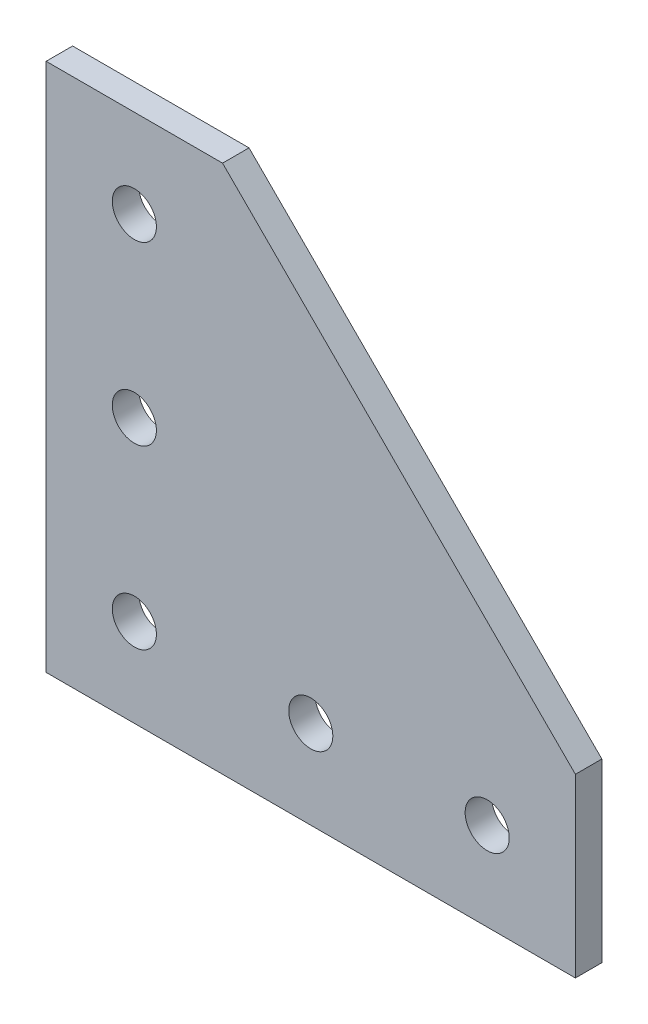
ISO-10303-21;
HEADER;
FILE_DESCRIPTION(('STEP AP214'),'2;1');
FILE_NAME('part.step','',(''),(''),'','','');
FILE_SCHEMA(('AUTOMOTIVE_DESIGN { 1 0 10303 214 1 1 1 1 }'));
ENDSEC;
DATA;
#1=APPLICATION_CONTEXT('core data for automotive mechanical design processes');
#2=APPLICATION_PROTOCOL_DEFINITION('international standard','automotive_design',2000,#1);
#3=PRODUCT_CONTEXT('',#1,'mechanical');
#4=PRODUCT('Part','Part','',(#3));
#5=PRODUCT_RELATED_PRODUCT_CATEGORY('part','',(#4));
#6=PRODUCT_DEFINITION_FORMATION('','',#4);
#7=PRODUCT_DEFINITION_CONTEXT('part definition',#1,'design');
#8=PRODUCT_DEFINITION('design','',#6,#7);
#9=PRODUCT_DEFINITION_SHAPE('','',#8);
#10=(LENGTH_UNIT() NAMED_UNIT(*) SI_UNIT(.MILLI.,.METRE.));
#11=(NAMED_UNIT(*) PLANE_ANGLE_UNIT() SI_UNIT($,.RADIAN.));
#12=(NAMED_UNIT(*) SI_UNIT($,.STERADIAN.) SOLID_ANGLE_UNIT());
#13=UNCERTAINTY_MEASURE_WITH_UNIT(LENGTH_MEASURE(1.E-05),#10,'distance_accuracy_value','');
#14=(GEOMETRIC_REPRESENTATION_CONTEXT(3) GLOBAL_UNCERTAINTY_ASSIGNED_CONTEXT((#13)) GLOBAL_UNIT_ASSIGNED_CONTEXT((#10,
#11,#12)) REPRESENTATION_CONTEXT('',''));
#15=CARTESIAN_POINT('',(0.,0.,0.));
#16=DIRECTION('',(0.,0.,1.));
#17=DIRECTION('',(1.,0.,0.));
#18=AXIS2_PLACEMENT_3D('',#15,#16,#17);
#19=CARTESIAN_POINT('',(0.,0.,-3.));
#20=DIRECTION('',(-1.,0.,0.));
#21=DIRECTION('',(0.,0.,1.));
#22=AXIS2_PLACEMENT_3D('',#19,#20,#21);
#23=PLANE('',#22);
#24=DIRECTION('',(0.,-1.,0.));
#25=VECTOR('',#24,1.);
#26=CARTESIAN_POINT('',(0.,0.,0.));
#27=LINE('',#26,#25);
#28=CARTESIAN_POINT('',(0.,60.,0.));
#29=VERTEX_POINT('',#28);
#30=CARTESIAN_POINT('',(0.,0.,0.));
#31=VERTEX_POINT('',#30);
#32=EDGE_CURVE('E111',#29,#31,#27,.T.);
#33=ORIENTED_EDGE('',*,*,#32,.F.);
#34=DIRECTION('',(0.,0.,1.));
#35=VECTOR('',#34,1.);
#36=CARTESIAN_POINT('',(0.,60.,-3.));
#37=LINE('',#36,#35);
#38=CARTESIAN_POINT('',(0.,60.,-3.));
#39=VERTEX_POINT('',#38);
#40=EDGE_CURVE('E11',#39,#29,#37,.T.);
#41=ORIENTED_EDGE('',*,*,#40,.F.);
#42=DIRECTION('',(0.,-1.,0.));
#43=VECTOR('',#42,1.);
#44=CARTESIAN_POINT('',(0.,0.,-3.));
#45=LINE('',#44,#43);
#46=CARTESIAN_POINT('',(0.,0.,-3.));
#47=VERTEX_POINT('',#46);
#48=EDGE_CURVE('E106',#39,#47,#45,.T.);
#49=ORIENTED_EDGE('',*,*,#48,.T.);
#50=DIRECTION('',(0.,0.,1.));
#51=VECTOR('',#50,1.);
#52=CARTESIAN_POINT('',(0.,0.,-3.));
#53=LINE('',#52,#51);
#54=EDGE_CURVE('E37',#47,#31,#53,.T.);
#55=ORIENTED_EDGE('',*,*,#54,.T.);
#56=EDGE_LOOP('',(#33,#41,#49,#55));
#57=FACE_BOUND('',#56,.T.);
#58=ADVANCED_FACE('F34',(#57),#23,.T.);
#59=CARTESIAN_POINT('',(0.,60.,-3.));
#60=DIRECTION('',(0.,1.,0.));
#61=DIRECTION('',(0.,0.,1.));
#62=AXIS2_PLACEMENT_3D('',#59,#60,#61);
#63=PLANE('',#62);
#64=DIRECTION('',(-1.,0.,0.));
#65=VECTOR('',#64,1.);
#66=CARTESIAN_POINT('',(0.,60.,0.));
#67=LINE('',#66,#65);
#68=CARTESIAN_POINT('',(20.,60.,0.));
#69=VERTEX_POINT('',#68);
#70=EDGE_CURVE('E121',#69,#29,#67,.T.);
#71=ORIENTED_EDGE('',*,*,#70,.F.);
#72=DIRECTION('',(0.,0.,1.));
#73=VECTOR('',#72,1.);
#74=CARTESIAN_POINT('',(20.,60.,-3.));
#75=LINE('',#74,#73);
#76=CARTESIAN_POINT('',(20.,60.,-3.));
#77=VERTEX_POINT('',#76);
#78=EDGE_CURVE('E43',#77,#69,#75,.T.);
#79=ORIENTED_EDGE('',*,*,#78,.F.);
#80=DIRECTION('',(-1.,0.,0.));
#81=VECTOR('',#80,1.);
#82=CARTESIAN_POINT('',(0.,60.,-3.));
#83=LINE('',#82,#81);
#84=EDGE_CURVE('E101',#77,#39,#83,.T.);
#85=ORIENTED_EDGE('',*,*,#84,.T.);
#86=ORIENTED_EDGE('',*,*,#40,.T.);
#87=EDGE_LOOP('',(#71,#79,#85,#86));
#88=FACE_BOUND('',#87,.T.);
#89=ADVANCED_FACE('F127',(#88),#63,.T.);
#90=CARTESIAN_POINT('',(20.,60.,-3.));
#91=DIRECTION('',(0.707106781186547,0.707106781186547,0.));
#92=DIRECTION('',(-0.707106781186548,0.707106781186548,0.));
#93=AXIS2_PLACEMENT_3D('',#90,#91,#92);
#94=PLANE('',#93);
#95=DIRECTION('',(-0.707106781186548,0.707106781186548,0.));
#96=VECTOR('',#95,1.);
#97=CARTESIAN_POINT('',(20.,60.,0.));
#98=LINE('',#97,#96);
#99=CARTESIAN_POINT('',(60.,20.,0.));
#100=VERTEX_POINT('',#99);
#101=EDGE_CURVE('E90',#100,#69,#98,.T.);
#102=ORIENTED_EDGE('',*,*,#101,.F.);
#103=DIRECTION('',(0.,0.,1.));
#104=VECTOR('',#103,1.);
#105=CARTESIAN_POINT('',(60.,20.,-3.));
#106=LINE('',#105,#104);
#107=CARTESIAN_POINT('',(60.,20.,-3.));
#108=VERTEX_POINT('',#107);
#109=EDGE_CURVE('E85',#108,#100,#106,.T.);
#110=ORIENTED_EDGE('',*,*,#109,.F.);
#111=DIRECTION('',(-0.707106781186548,0.707106781186548,0.));
#112=VECTOR('',#111,1.);
#113=CARTESIAN_POINT('',(20.,60.,-3.));
#114=LINE('',#113,#112);
#115=EDGE_CURVE('E88',#108,#77,#114,.T.);
#116=ORIENTED_EDGE('',*,*,#115,.T.);
#117=ORIENTED_EDGE('',*,*,#78,.T.);
#118=EDGE_LOOP('',(#102,#110,#116,#117));
#119=FACE_BOUND('',#118,.T.);
#120=ADVANCED_FACE('F87',(#119),#94,.T.);
#121=CARTESIAN_POINT('',(60.,20.,-3.));
#122=DIRECTION('',(1.,0.,0.));
#123=DIRECTION('',(0.,0.,-1.));
#124=AXIS2_PLACEMENT_3D('',#121,#122,#123);
#125=PLANE('',#124);
#126=DIRECTION('',(0.,1.,0.));
#127=VECTOR('',#126,1.);
#128=CARTESIAN_POINT('',(60.,20.,0.));
#129=LINE('',#128,#127);
#130=CARTESIAN_POINT('',(60.,0.,0.));
#131=VERTEX_POINT('',#130);
#132=EDGE_CURVE('E118',#131,#100,#129,.T.);
#133=ORIENTED_EDGE('',*,*,#132,.F.);
#134=DIRECTION('',(0.,0.,1.));
#135=VECTOR('',#134,1.);
#136=CARTESIAN_POINT('',(60.,0.,-3.));
#137=LINE('',#136,#135);
#138=CARTESIAN_POINT('',(60.,0.,-3.));
#139=VERTEX_POINT('',#138);
#140=EDGE_CURVE('E95',#139,#131,#137,.T.);
#141=ORIENTED_EDGE('',*,*,#140,.F.);
#142=DIRECTION('',(0.,1.,0.));
#143=VECTOR('',#142,1.);
#144=CARTESIAN_POINT('',(60.,20.,-3.));
#145=LINE('',#144,#143);
#146=EDGE_CURVE('E100',#139,#108,#145,.T.);
#147=ORIENTED_EDGE('',*,*,#146,.T.);
#148=ORIENTED_EDGE('',*,*,#109,.T.);
#149=EDGE_LOOP('',(#133,#141,#147,#148));
#150=FACE_BOUND('',#149,.T.);
#151=ADVANCED_FACE('F103',(#150),#125,.T.);
#152=CARTESIAN_POINT('',(0.,0.,-3.));
#153=DIRECTION('',(0.,-1.,0.));
#154=DIRECTION('',(0.,0.,-1.));
#155=AXIS2_PLACEMENT_3D('',#152,#153,#154);
#156=PLANE('',#155);
#157=DIRECTION('',(1.,0.,0.));
#158=VECTOR('',#157,1.);
#159=CARTESIAN_POINT('',(0.,0.,0.));
#160=LINE('',#159,#158);
#161=EDGE_CURVE('E114',#31,#131,#160,.T.);
#162=ORIENTED_EDGE('',*,*,#161,.F.);
#163=ORIENTED_EDGE('',*,*,#54,.F.);
#164=DIRECTION('',(1.,0.,0.));
#165=VECTOR('',#164,1.);
#166=CARTESIAN_POINT('',(0.,0.,-3.));
#167=LINE('',#166,#165);
#168=EDGE_CURVE('E104',#47,#139,#167,.T.);
#169=ORIENTED_EDGE('',*,*,#168,.T.);
#170=ORIENTED_EDGE('',*,*,#140,.T.);
#171=EDGE_LOOP('',(#162,#163,#169,#170));
#172=FACE_BOUND('',#171,.T.);
#173=ADVANCED_FACE('F124',(#172),#156,.T.);
#174=CARTESIAN_POINT('',(0.,0.,-3.));
#175=DIRECTION('',(0.,0.,-1.));
#176=DIRECTION('',(-1.,0.,0.));
#177=AXIS2_PLACEMENT_3D('',#174,#175,#176);
#178=PLANE('',#177);
#179=CARTESIAN_POINT('',(9.99999999999986,50.,-3.));
#180=DIRECTION('',(0.,0.,1.));
#181=DIRECTION('',(1.,0.,0.));
#182=AXIS2_PLACEMENT_3D('',#179,#180,#181);
#183=CIRCLE('',#182,2.5);
#184=CARTESIAN_POINT('',(12.4999999999999,50.,-3.));
#185=VERTEX_POINT('',#184);
#186=EDGE_CURVE('E174',#185,#185,#183,.T.);
#187=ORIENTED_EDGE('',*,*,#186,.T.);
#188=EDGE_LOOP('',(#187));
#189=FACE_BOUND('',#188,.T.);
#190=CARTESIAN_POINT('',(9.99999999999993,30.,-3.));
#191=DIRECTION('',(0.,0.,1.));
#192=DIRECTION('',(1.,0.,0.));
#193=AXIS2_PLACEMENT_3D('',#190,#191,#192);
#194=CIRCLE('',#193,2.5);
#195=CARTESIAN_POINT('',(12.4999999999999,30.,-3.));
#196=VERTEX_POINT('',#195);
#197=EDGE_CURVE('E182',#196,#196,#194,.T.);
#198=ORIENTED_EDGE('',*,*,#197,.T.);
#199=EDGE_LOOP('',(#198));
#200=FACE_BOUND('',#199,.T.);
#201=CARTESIAN_POINT('',(50.,10.,-3.));
#202=DIRECTION('',(0.,0.,1.));
#203=DIRECTION('',(1.,0.,0.));
#204=AXIS2_PLACEMENT_3D('',#201,#202,#203);
#205=CIRCLE('',#204,2.5);
#206=CARTESIAN_POINT('',(52.5,10.,-3.));
#207=VERTEX_POINT('',#206);
#208=EDGE_CURVE('E188',#207,#207,#205,.T.);
#209=ORIENTED_EDGE('',*,*,#208,.T.);
#210=EDGE_LOOP('',(#209));
#211=FACE_BOUND('',#210,.T.);
#212=CARTESIAN_POINT('',(30.,10.,-3.));
#213=DIRECTION('',(0.,0.,1.));
#214=DIRECTION('',(1.,0.,0.));
#215=AXIS2_PLACEMENT_3D('',#212,#213,#214);
#216=CIRCLE('',#215,2.5);
#217=CARTESIAN_POINT('',(32.5,10.,-3.));
#218=VERTEX_POINT('',#217);
#219=EDGE_CURVE('E194',#218,#218,#216,.T.);
#220=ORIENTED_EDGE('',*,*,#219,.T.);
#221=EDGE_LOOP('',(#220));
#222=FACE_BOUND('',#221,.T.);
#223=CARTESIAN_POINT('',(10.,10.,-3.));
#224=DIRECTION('',(0.,0.,1.));
#225=DIRECTION('',(1.,0.,0.));
#226=AXIS2_PLACEMENT_3D('',#223,#224,#225);
#227=CIRCLE('',#226,2.5);
#228=CARTESIAN_POINT('',(12.5,10.,-3.));
#229=VERTEX_POINT('',#228);
#230=EDGE_CURVE('E115',#229,#229,#227,.T.);
#231=ORIENTED_EDGE('',*,*,#230,.T.);
#232=EDGE_LOOP('',(#231));
#233=FACE_BOUND('',#232,.T.);
#234=ORIENTED_EDGE('',*,*,#48,.F.);
#235=ORIENTED_EDGE('',*,*,#84,.F.);
#236=ORIENTED_EDGE('',*,*,#115,.F.);
#237=ORIENTED_EDGE('',*,*,#146,.F.);
#238=ORIENTED_EDGE('',*,*,#168,.F.);
#239=EDGE_LOOP('',(#234,#235,#236,#237,#238));
#240=FACE_BOUND('',#239,.T.);
#241=ADVANCED_FACE('F99',(#189,#200,#211,#222,#233,#240),#178,.T.);
#242=CARTESIAN_POINT('',(0.,0.,0.));
#243=DIRECTION('',(0.,0.,-1.));
#244=DIRECTION('',(-1.,0.,0.));
#245=AXIS2_PLACEMENT_3D('',#242,#243,#244);
#246=PLANE('',#245);
#247=CARTESIAN_POINT('',(9.99999999999986,50.,0.));
#248=DIRECTION('',(0.,0.,1.));
#249=DIRECTION('',(1.,0.,0.));
#250=AXIS2_PLACEMENT_3D('',#247,#248,#249);
#251=CIRCLE('',#250,2.5);
#252=CARTESIAN_POINT('',(12.4999999999999,50.,0.));
#253=VERTEX_POINT('',#252);
#254=EDGE_CURVE('E177',#253,#253,#251,.T.);
#255=ORIENTED_EDGE('',*,*,#254,.F.);
#256=EDGE_LOOP('',(#255));
#257=FACE_BOUND('',#256,.T.);
#258=CARTESIAN_POINT('',(9.99999999999993,30.,0.));
#259=DIRECTION('',(0.,0.,1.));
#260=DIRECTION('',(1.,0.,0.));
#261=AXIS2_PLACEMENT_3D('',#258,#259,#260);
#262=CIRCLE('',#261,2.5);
#263=CARTESIAN_POINT('',(12.4999999999999,30.,0.));
#264=VERTEX_POINT('',#263);
#265=EDGE_CURVE('E179',#264,#264,#262,.T.);
#266=ORIENTED_EDGE('',*,*,#265,.F.);
#267=EDGE_LOOP('',(#266));
#268=FACE_BOUND('',#267,.T.);
#269=CARTESIAN_POINT('',(50.,10.,0.));
#270=DIRECTION('',(0.,0.,1.));
#271=DIRECTION('',(1.,0.,0.));
#272=AXIS2_PLACEMENT_3D('',#269,#270,#271);
#273=CIRCLE('',#272,2.5);
#274=CARTESIAN_POINT('',(52.5,10.,0.));
#275=VERTEX_POINT('',#274);
#276=EDGE_CURVE('E185',#275,#275,#273,.T.);
#277=ORIENTED_EDGE('',*,*,#276,.F.);
#278=EDGE_LOOP('',(#277));
#279=FACE_BOUND('',#278,.T.);
#280=CARTESIAN_POINT('',(30.,10.,0.));
#281=DIRECTION('',(0.,0.,1.));
#282=DIRECTION('',(1.,0.,0.));
#283=AXIS2_PLACEMENT_3D('',#280,#281,#282);
#284=CIRCLE('',#283,2.5);
#285=CARTESIAN_POINT('',(32.5,10.,0.));
#286=VERTEX_POINT('',#285);
#287=EDGE_CURVE('E191',#286,#286,#284,.T.);
#288=ORIENTED_EDGE('',*,*,#287,.F.);
#289=EDGE_LOOP('',(#288));
#290=FACE_BOUND('',#289,.T.);
#291=CARTESIAN_POINT('',(10.,10.,0.));
#292=DIRECTION('',(0.,0.,1.));
#293=DIRECTION('',(1.,0.,0.));
#294=AXIS2_PLACEMENT_3D('',#291,#292,#293);
#295=CIRCLE('',#294,2.5);
#296=CARTESIAN_POINT('',(12.5,10.,0.));
#297=VERTEX_POINT('',#296);
#298=EDGE_CURVE('E197',#297,#297,#295,.T.);
#299=ORIENTED_EDGE('',*,*,#298,.F.);
#300=EDGE_LOOP('',(#299));
#301=FACE_BOUND('',#300,.T.);
#302=ORIENTED_EDGE('',*,*,#32,.T.);
#303=ORIENTED_EDGE('',*,*,#161,.T.);
#304=ORIENTED_EDGE('',*,*,#132,.T.);
#305=ORIENTED_EDGE('',*,*,#101,.T.);
#306=ORIENTED_EDGE('',*,*,#70,.T.);
#307=EDGE_LOOP('',(#302,#303,#304,#305,#306));
#308=FACE_BOUND('',#307,.T.);
#309=ADVANCED_FACE('F126',(#257,#268,#279,#290,#301,#308),#246,.F.);
#310=CARTESIAN_POINT('',(10.,10.,-3.));
#311=DIRECTION('',(0.,0.,1.));
#312=DIRECTION('',(1.,0.,0.));
#313=AXIS2_PLACEMENT_3D('',#310,#311,#312);
#314=CYLINDRICAL_SURFACE('',#313,2.5);
#315=ORIENTED_EDGE('',*,*,#230,.F.);
#316=EDGE_LOOP('',(#315));
#317=FACE_BOUND('',#316,.T.);
#318=ORIENTED_EDGE('',*,*,#298,.T.);
#319=EDGE_LOOP('',(#318));
#320=FACE_BOUND('',#319,.T.);
#321=ADVANCED_FACE('F147',(#317,#320),#314,.F.);
#322=CARTESIAN_POINT('',(30.,10.,-3.));
#323=DIRECTION('',(0.,0.,1.));
#324=DIRECTION('',(1.,0.,0.));
#325=AXIS2_PLACEMENT_3D('',#322,#323,#324);
#326=CYLINDRICAL_SURFACE('',#325,2.5);
#327=ORIENTED_EDGE('',*,*,#219,.F.);
#328=EDGE_LOOP('',(#327));
#329=FACE_BOUND('',#328,.T.);
#330=ORIENTED_EDGE('',*,*,#287,.T.);
#331=EDGE_LOOP('',(#330));
#332=FACE_BOUND('',#331,.T.);
#333=ADVANCED_FACE('F154',(#329,#332),#326,.F.);
#334=CARTESIAN_POINT('',(50.,10.,-3.));
#335=DIRECTION('',(0.,0.,1.));
#336=DIRECTION('',(1.,0.,0.));
#337=AXIS2_PLACEMENT_3D('',#334,#335,#336);
#338=CYLINDRICAL_SURFACE('',#337,2.5);
#339=ORIENTED_EDGE('',*,*,#208,.F.);
#340=EDGE_LOOP('',(#339));
#341=FACE_BOUND('',#340,.T.);
#342=ORIENTED_EDGE('',*,*,#276,.T.);
#343=EDGE_LOOP('',(#342));
#344=FACE_BOUND('',#343,.T.);
#345=ADVANCED_FACE('F158',(#341,#344),#338,.F.);
#346=CARTESIAN_POINT('',(9.99999999999993,30.,-3.));
#347=DIRECTION('',(0.,0.,1.));
#348=DIRECTION('',(1.,0.,0.));
#349=AXIS2_PLACEMENT_3D('',#346,#347,#348);
#350=CYLINDRICAL_SURFACE('',#349,2.5);
#351=ORIENTED_EDGE('',*,*,#197,.F.);
#352=EDGE_LOOP('',(#351));
#353=FACE_BOUND('',#352,.T.);
#354=ORIENTED_EDGE('',*,*,#265,.T.);
#355=EDGE_LOOP('',(#354));
#356=FACE_BOUND('',#355,.T.);
#357=ADVANCED_FACE('F162',(#353,#356),#350,.F.);
#358=CARTESIAN_POINT('',(9.99999999999986,50.,-3.));
#359=DIRECTION('',(0.,0.,1.));
#360=DIRECTION('',(1.,0.,0.));
#361=AXIS2_PLACEMENT_3D('',#358,#359,#360);
#362=CYLINDRICAL_SURFACE('',#361,2.5);
#363=ORIENTED_EDGE('',*,*,#186,.F.);
#364=EDGE_LOOP('',(#363));
#365=FACE_BOUND('',#364,.T.);
#366=ORIENTED_EDGE('',*,*,#254,.T.);
#367=EDGE_LOOP('',(#366));
#368=FACE_BOUND('',#367,.T.);
#369=ADVANCED_FACE('F166',(#365,#368),#362,.F.);
#370=CLOSED_SHELL('',(#58,#89,#120,#151,#173,#241,#309,#321,#333,#345,#357,#369));
#371=MANIFOLD_SOLID_BREP('B2',#370);
#372=ADVANCED_BREP_SHAPE_REPRESENTATION('',(#18,#371),#14);
#373=SHAPE_DEFINITION_REPRESENTATION(#9,#372);
ENDSEC;
END-ISO-10303-21;
